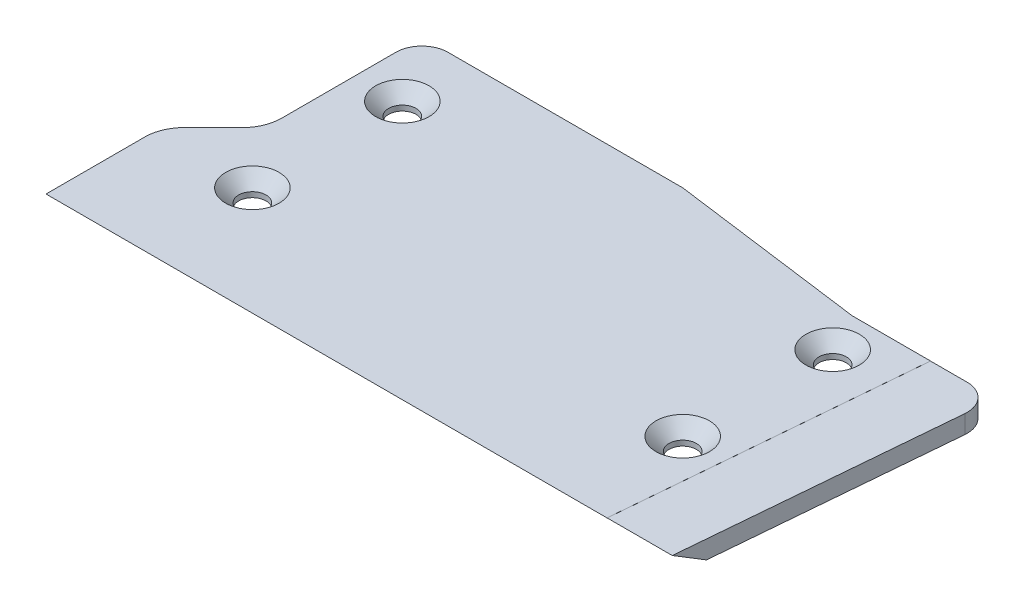
ISO-10303-21;
HEADER;
FILE_DESCRIPTION(('STEP AP214'),'2;1');
FILE_NAME('part.step','',(''),(''),'','','');
FILE_SCHEMA(('AUTOMOTIVE_DESIGN { 1 0 10303 214 1 1 1 1 }'));
ENDSEC;
DATA;
#1=APPLICATION_CONTEXT('core data for automotive mechanical design processes');
#2=APPLICATION_PROTOCOL_DEFINITION('international standard','automotive_design',2000,#1);
#3=PRODUCT_CONTEXT('',#1,'mechanical');
#4=PRODUCT('Part','Part','',(#3));
#5=PRODUCT_RELATED_PRODUCT_CATEGORY('part','',(#4));
#6=PRODUCT_DEFINITION_FORMATION('','',#4);
#7=PRODUCT_DEFINITION_CONTEXT('part definition',#1,'design');
#8=PRODUCT_DEFINITION('design','',#6,#7);
#9=PRODUCT_DEFINITION_SHAPE('','',#8);
#10=(LENGTH_UNIT() NAMED_UNIT(*) SI_UNIT(.MILLI.,.METRE.));
#11=(NAMED_UNIT(*) PLANE_ANGLE_UNIT() SI_UNIT($,.RADIAN.));
#12=(NAMED_UNIT(*) SI_UNIT($,.STERADIAN.) SOLID_ANGLE_UNIT());
#13=UNCERTAINTY_MEASURE_WITH_UNIT(LENGTH_MEASURE(1.E-05),#10,'distance_accuracy_value','');
#14=(GEOMETRIC_REPRESENTATION_CONTEXT(3) GLOBAL_UNCERTAINTY_ASSIGNED_CONTEXT((#13)) GLOBAL_UNIT_ASSIGNED_CONTEXT((#10,
#11,#12)) REPRESENTATION_CONTEXT('',''));
#15=CARTESIAN_POINT('',(0.,0.,0.));
#16=DIRECTION('',(0.,0.,1.));
#17=DIRECTION('',(1.,0.,0.));
#18=AXIS2_PLACEMENT_3D('',#15,#16,#17);
#19=CARTESIAN_POINT('',(92.,2.8,0.));
#20=DIRECTION('',(-0.996240588195683,0.,-0.0866296163648421));
#21=DIRECTION('',(-0.0866296163648421,0.,0.996240588195683));
#22=AXIS2_PLACEMENT_3D('',#19,#20,#21);
#23=PLANE('',#22);
#24=DIRECTION('',(0.0866296163648421,0.,-0.996240588195683));
#25=VECTOR('',#24,1.);
#26=CARTESIAN_POINT('',(92.,2.79,0.));
#27=LINE('',#26,#25);
#28=CARTESIAN_POINT('',(88.0316287538773,2.79000000000002,45.6362693304105));
#29=VERTEX_POINT('',#28);
#30=CARTESIAN_POINT('',(91.6220418725688,2.79,4.34651846545937));
#31=VERTEX_POINT('',#30);
#32=EDGE_CURVE('E58',#29,#31,#27,.T.);
#33=ORIENTED_EDGE('',*,*,#32,.F.);
#34=DIRECTION('',(0.0750939261482641,-0.498588232476366,-0.863580150705036));
#35=VECTOR('',#34,1.);
#36=CARTESIAN_POINT('',(88.,3.00000000000004,46.));
#37=LINE('',#36,#35);
#38=CARTESIAN_POINT('',(88.4518393411049,0.,40.8038475772933));
#39=VERTEX_POINT('',#38);
#40=EDGE_CURVE('E219',#29,#39,#37,.T.);
#41=ORIENTED_EDGE('',*,*,#40,.T.);
#42=DIRECTION('',(0.0866296163648421,0.,-0.996240588195683));
#43=VECTOR('',#42,1.);
#44=CARTESIAN_POINT('',(92.,0.,0.));
#45=LINE('',#44,#43);
#46=CARTESIAN_POINT('',(91.6220418725688,0.,4.34651846545937));
#47=VERTEX_POINT('',#46);
#48=EDGE_CURVE('E203',#39,#47,#45,.T.);
#49=ORIENTED_EDGE('',*,*,#48,.T.);
#50=DIRECTION('',(0.,-1.,0.));
#51=VECTOR('',#50,1.);
#52=CARTESIAN_POINT('',(91.6220418725688,2.8,4.34651846545937));
#53=LINE('',#52,#51);
#54=EDGE_CURVE('E283',#47,#31,#53,.F.);
#55=ORIENTED_EDGE('',*,*,#54,.T.);
#56=EDGE_LOOP('',(#33,#41,#49,#55));
#57=FACE_BOUND('',#56,.T.);
#58=ADVANCED_FACE('F43',(#57),#23,.F.);
#59=CARTESIAN_POINT('',(87.637079519786,2.8,4.));
#60=DIRECTION('',(0.,-1.,0.));
#61=DIRECTION('',(0.,0.,-1.));
#62=AXIS2_PLACEMENT_3D('',#59,#60,#61);
#63=CYLINDRICAL_SURFACE('',#62,4.);
#64=DIRECTION('',(0.,-1.,0.));
#65=VECTOR('',#64,1.);
#66=CARTESIAN_POINT('',(87.637079519786,2.8,0.));
#67=LINE('',#66,#65);
#68=CARTESIAN_POINT('',(87.637079519786,2.79,0.));
#69=VERTEX_POINT('',#68);
#70=CARTESIAN_POINT('',(87.637079519786,0.,0.));
#71=VERTEX_POINT('',#70);
#72=EDGE_CURVE('E281',#69,#71,#67,.T.);
#73=ORIENTED_EDGE('',*,*,#72,.F.);
#74=CARTESIAN_POINT('',(87.637079519786,2.79,4.));
#75=DIRECTION('',(0.,1.,0.));
#76=DIRECTION('',(0.,0.,1.));
#77=AXIS2_PLACEMENT_3D('',#74,#75,#76);
#78=CIRCLE('',#77,4.);
#79=EDGE_CURVE('E51',#69,#31,#78,.F.);
#80=ORIENTED_EDGE('',*,*,#79,.T.);
#81=ORIENTED_EDGE('',*,*,#54,.F.);
#82=CARTESIAN_POINT('',(87.637079519786,0.,4.));
#83=DIRECTION('',(0.,-1.,0.));
#84=DIRECTION('',(0.,0.,-1.));
#85=AXIS2_PLACEMENT_3D('',#82,#83,#84);
#86=CIRCLE('',#85,4.);
#87=EDGE_CURVE('E274',#71,#47,#86,.T.);
#88=ORIENTED_EDGE('',*,*,#87,.F.);
#89=EDGE_LOOP('',(#73,#80,#81,#88));
#90=FACE_BOUND('',#89,.T.);
#91=ADVANCED_FACE('F45',(#90),#63,.T.);
#92=CARTESIAN_POINT('',(0.,2.8,-4.));
#93=DIRECTION('',(1.,0.,0.));
#94=DIRECTION('',(0.,0.,-1.));
#95=AXIS2_PLACEMENT_3D('',#92,#93,#94);
#96=PLANE('',#95);
#97=DIRECTION('',(0.,0.,1.));
#98=VECTOR('',#97,1.);
#99=CARTESIAN_POINT('',(0.,2.8,-4.));
#100=LINE('',#99,#98);
#101=CARTESIAN_POINT('',(0.,2.8,0.));
#102=VERTEX_POINT('',#101);
#103=CARTESIAN_POINT('',(0.,2.8,17.5147186257614));
#104=VERTEX_POINT('',#103);
#105=EDGE_CURVE('E183',#102,#104,#100,.T.);
#106=ORIENTED_EDGE('',*,*,#105,.F.);
#107=DIRECTION('',(0.,-1.,0.));
#108=VECTOR('',#107,1.);
#109=CARTESIAN_POINT('',(0.,2.8,0.));
#110=LINE('',#109,#108);
#111=CARTESIAN_POINT('',(0.,0.,0.));
#112=VERTEX_POINT('',#111);
#113=EDGE_CURVE('E271',#102,#112,#110,.T.);
#114=ORIENTED_EDGE('',*,*,#113,.T.);
#115=DIRECTION('',(0.,0.,1.));
#116=VECTOR('',#115,1.);
#117=CARTESIAN_POINT('',(0.,0.,-4.));
#118=LINE('',#117,#116);
#119=CARTESIAN_POINT('',(0.,0.,17.5147186257614));
#120=VERTEX_POINT('',#119);
#121=EDGE_CURVE('E182',#112,#120,#118,.T.);
#122=ORIENTED_EDGE('',*,*,#121,.T.);
#123=DIRECTION('',(0.,-1.,0.));
#124=VECTOR('',#123,1.);
#125=CARTESIAN_POINT('',(0.,2.8,17.5147186257614));
#126=LINE('',#125,#124);
#127=EDGE_CURVE('E256',#120,#104,#126,.F.);
#128=ORIENTED_EDGE('',*,*,#127,.T.);
#129=EDGE_LOOP('',(#106,#114,#122,#128));
#130=FACE_BOUND('',#129,.T.);
#131=ADVANCED_FACE('F323',(#130),#96,.F.);
#132=CARTESIAN_POINT('',(-8.,2.8,28.));
#133=DIRECTION('',(0.707106781186547,0.,0.707106781186547));
#134=DIRECTION('',(0.707106781186548,0.,-0.707106781186548));
#135=AXIS2_PLACEMENT_3D('',#132,#133,#134);
#136=PLANE('',#135);
#137=DIRECTION('',(-0.707106781186548,0.,0.707106781186548));
#138=VECTOR('',#137,1.);
#139=CARTESIAN_POINT('',(-8.,2.8,28.));
#140=LINE('',#139,#138);
#141=CARTESIAN_POINT('',(-1.75735931288071,2.8,21.7573593128807));
#142=VERTEX_POINT('',#141);
#143=CARTESIAN_POINT('',(-6.24264068711929,2.8,26.2426406871193));
#144=VERTEX_POINT('',#143);
#145=EDGE_CURVE('E185',#142,#144,#140,.T.);
#146=ORIENTED_EDGE('',*,*,#145,.F.);
#147=DIRECTION('',(0.,-1.,0.));
#148=VECTOR('',#147,1.);
#149=CARTESIAN_POINT('',(-1.75735931288072,0.,21.7573593128807));
#150=LINE('',#149,#148);
#151=CARTESIAN_POINT('',(-1.75735931288071,0.,21.7573593128807));
#152=VERTEX_POINT('',#151);
#153=EDGE_CURVE('E253',#142,#152,#150,.T.);
#154=ORIENTED_EDGE('',*,*,#153,.T.);
#155=DIRECTION('',(-0.707106781186548,0.,0.707106781186548));
#156=VECTOR('',#155,1.);
#157=CARTESIAN_POINT('',(-8.,0.,28.));
#158=LINE('',#157,#156);
#159=CARTESIAN_POINT('',(-6.24264068711929,0.,26.2426406871193));
#160=VERTEX_POINT('',#159);
#161=EDGE_CURVE('E198',#152,#160,#158,.T.);
#162=ORIENTED_EDGE('',*,*,#161,.T.);
#163=DIRECTION('',(0.,-1.,0.));
#164=VECTOR('',#163,1.);
#165=CARTESIAN_POINT('',(-6.24264068711929,2.8,26.2426406871193));
#166=LINE('',#165,#164);
#167=EDGE_CURVE('E251',#160,#144,#166,.F.);
#168=ORIENTED_EDGE('',*,*,#167,.T.);
#169=EDGE_LOOP('',(#146,#154,#162,#168));
#170=FACE_BOUND('',#169,.T.);
#171=ADVANCED_FACE('F310',(#170),#136,.F.);
#172=CARTESIAN_POINT('',(-8.,2.8,46.));
#173=DIRECTION('',(1.,0.,0.));
#174=DIRECTION('',(0.,0.,-1.));
#175=AXIS2_PLACEMENT_3D('',#172,#173,#174);
#176=PLANE('',#175);
#177=DIRECTION('',(0.,0.,1.));
#178=VECTOR('',#177,1.);
#179=CARTESIAN_POINT('',(-8.,2.8,46.));
#180=LINE('',#179,#178);
#181=CARTESIAN_POINT('',(-8.,2.8,30.4852813742386));
#182=VERTEX_POINT('',#181);
#183=CARTESIAN_POINT('',(-8.,2.8,45.6535898384862));
#184=VERTEX_POINT('',#183);
#185=EDGE_CURVE('E189',#182,#184,#180,.T.);
#186=ORIENTED_EDGE('',*,*,#185,.F.);
#187=DIRECTION('',(0.,-1.,0.));
#188=VECTOR('',#187,1.);
#189=CARTESIAN_POINT('',(-8.,2.8,30.4852813742386));
#190=LINE('',#189,#188);
#191=CARTESIAN_POINT('',(-8.,0.,30.4852813742386));
#192=VERTEX_POINT('',#191);
#193=EDGE_CURVE('E259',#182,#192,#190,.T.);
#194=ORIENTED_EDGE('',*,*,#193,.T.);
#195=DIRECTION('',(0.,0.,1.));
#196=VECTOR('',#195,1.);
#197=CARTESIAN_POINT('',(-8.,0.,46.));
#198=LINE('',#197,#196);
#199=CARTESIAN_POINT('',(-8.,0.,40.8038475772933));
#200=VERTEX_POINT('',#199);
#201=EDGE_CURVE('E201',#192,#200,#198,.T.);
#202=ORIENTED_EDGE('',*,*,#201,.T.);
#203=DIRECTION('',(0.,0.499999999999997,0.866025403784441));
#204=VECTOR('',#203,1.);
#205=CARTESIAN_POINT('',(-8.00000000000001,3.00000000000003,46.));
#206=LINE('',#205,#204);
#207=EDGE_CURVE('E224',#200,#184,#206,.T.);
#208=ORIENTED_EDGE('',*,*,#207,.T.);
#209=EDGE_LOOP('',(#186,#194,#202,#208));
#210=FACE_BOUND('',#209,.T.);
#211=ADVANCED_FACE('F303',(#210),#176,.F.);
#212=CARTESIAN_POINT('',(70.,2.8,0.));
#213=DIRECTION('',(0.,0.,1.));
#214=DIRECTION('',(1.,0.,0.));
#215=AXIS2_PLACEMENT_3D('',#212,#213,#214);
#216=PLANE('',#215);
#217=DIRECTION('',(-1.,0.,0.));
#218=VECTOR('',#217,1.);
#219=CARTESIAN_POINT('',(70.,2.8,0.));
#220=LINE('',#219,#218);
#221=CARTESIAN_POINT('',(82.0111837990123,2.8,0.));
#222=VERTEX_POINT('',#221);
#223=CARTESIAN_POINT('',(70.,2.8,0.));
#224=VERTEX_POINT('',#223);
#225=EDGE_CURVE('E163',#222,#224,#220,.T.);
#226=ORIENTED_EDGE('',*,*,#225,.F.);
#227=DIRECTION('',(0.,1.,0.));
#228=VECTOR('',#227,1.);
#229=CARTESIAN_POINT('',(82.0111837990123,2.79,0.));
#230=LINE('',#229,#228);
#231=CARTESIAN_POINT('',(82.0111837990123,2.79,0.));
#232=VERTEX_POINT('',#231);
#233=EDGE_CURVE('E152',#232,#222,#230,.T.);
#234=ORIENTED_EDGE('',*,*,#233,.F.);
#235=DIRECTION('',(-1.,0.,0.));
#236=VECTOR('',#235,1.);
#237=CARTESIAN_POINT('',(70.,2.79,0.));
#238=LINE('',#237,#236);
#239=EDGE_CURVE('E144',#69,#232,#238,.T.);
#240=ORIENTED_EDGE('',*,*,#239,.F.);
#241=ORIENTED_EDGE('',*,*,#72,.T.);
#242=DIRECTION('',(-1.,0.,0.));
#243=VECTOR('',#242,1.);
#244=CARTESIAN_POINT('',(70.,0.,0.));
#245=LINE('',#244,#243);
#246=CARTESIAN_POINT('',(70.,0.,0.));
#247=VERTEX_POINT('',#246);
#248=EDGE_CURVE('E206',#71,#247,#245,.T.);
#249=ORIENTED_EDGE('',*,*,#248,.T.);
#250=DIRECTION('',(0.,-1.,0.));
#251=VECTOR('',#250,1.);
#252=CARTESIAN_POINT('',(70.,2.8,0.));
#253=LINE('',#252,#251);
#254=EDGE_CURVE('E213',#224,#247,#253,.T.);
#255=ORIENTED_EDGE('',*,*,#254,.F.);
#256=EDGE_LOOP('',(#226,#234,#240,#241,#249,#255));
#257=FACE_BOUND('',#256,.T.);
#258=ADVANCED_FACE('F161',(#257),#216,.F.);
#259=CARTESIAN_POINT('',(40.,2.8,-4.));
#260=DIRECTION('',(-0.132163720091018,0.,0.991227900682635));
#261=DIRECTION('',(0.991227900682635,0.,0.132163720091018));
#262=AXIS2_PLACEMENT_3D('',#259,#260,#261);
#263=PLANE('',#262);
#264=DIRECTION('',(-0.991227900682635,0.,-0.132163720091018));
#265=VECTOR('',#264,1.);
#266=CARTESIAN_POINT('',(40.,0.,-4.));
#267=LINE('',#266,#265);
#268=CARTESIAN_POINT('',(40.,0.,-4.));
#269=VERTEX_POINT('',#268);
#270=EDGE_CURVE('E208',#247,#269,#267,.T.);
#271=ORIENTED_EDGE('',*,*,#270,.T.);
#272=DIRECTION('',(0.,-1.,0.));
#273=VECTOR('',#272,1.);
#274=CARTESIAN_POINT('',(40.,2.8,-4.));
#275=LINE('',#274,#273);
#276=CARTESIAN_POINT('',(40.,2.8,-4.));
#277=VERTEX_POINT('',#276);
#278=EDGE_CURVE('E196',#277,#269,#275,.T.);
#279=ORIENTED_EDGE('',*,*,#278,.F.);
#280=DIRECTION('',(-0.991227900682635,0.,-0.132163720091018));
#281=VECTOR('',#280,1.);
#282=CARTESIAN_POINT('',(40.,2.8,-4.));
#283=LINE('',#282,#281);
#284=EDGE_CURVE('E192',#224,#277,#283,.T.);
#285=ORIENTED_EDGE('',*,*,#284,.F.);
#286=ORIENTED_EDGE('',*,*,#254,.T.);
#287=EDGE_LOOP('',(#271,#279,#285,#286));
#288=FACE_BOUND('',#287,.T.);
#289=ADVANCED_FACE('F333',(#288),#263,.F.);
#290=CARTESIAN_POINT('',(0.,2.8,-4.));
#291=DIRECTION('',(0.,0.,1.));
#292=DIRECTION('',(1.,0.,0.));
#293=AXIS2_PLACEMENT_3D('',#290,#291,#292);
#294=PLANE('',#293);
#295=DIRECTION('',(-1.,0.,0.));
#296=VECTOR('',#295,1.);
#297=CARTESIAN_POINT('',(0.,0.,-4.));
#298=LINE('',#297,#296);
#299=CARTESIAN_POINT('',(4.,0.,-4.));
#300=VERTEX_POINT('',#299);
#301=EDGE_CURVE('E186',#269,#300,#298,.T.);
#302=ORIENTED_EDGE('',*,*,#301,.T.);
#303=DIRECTION('',(0.,-1.,0.));
#304=VECTOR('',#303,1.);
#305=CARTESIAN_POINT('',(4.,2.8,-4.));
#306=LINE('',#305,#304);
#307=CARTESIAN_POINT('',(4.,2.8,-4.));
#308=VERTEX_POINT('',#307);
#309=EDGE_CURVE('E66',#300,#308,#306,.F.);
#310=ORIENTED_EDGE('',*,*,#309,.T.);
#311=DIRECTION('',(-1.,0.,0.));
#312=VECTOR('',#311,1.);
#313=CARTESIAN_POINT('',(0.,2.8,-4.));
#314=LINE('',#313,#312);
#315=EDGE_CURVE('E194',#277,#308,#314,.T.);
#316=ORIENTED_EDGE('',*,*,#315,.F.);
#317=ORIENTED_EDGE('',*,*,#278,.T.);
#318=EDGE_LOOP('',(#302,#310,#316,#317));
#319=FACE_BOUND('',#318,.T.);
#320=ADVANCED_FACE('F330',(#319),#294,.F.);
#321=CARTESIAN_POINT('',(0.,2.8,0.));
#322=DIRECTION('',(0.,-1.,0.));
#323=DIRECTION('',(0.,0.,-1.));
#324=AXIS2_PLACEMENT_3D('',#321,#322,#323);
#325=PLANE('',#324);
#326=CARTESIAN_POINT('',(73.,2.8,6.));
#327=DIRECTION('',(0.,-1.,0.));
#328=DIRECTION('',(0.,0.,-1.));
#329=AXIS2_PLACEMENT_3D('',#326,#327,#328);
#330=CIRCLE('',#329,4.10000000000001);
#331=CARTESIAN_POINT('',(73.,2.8,1.89999999999999));
#332=VERTEX_POINT('',#331);
#333=EDGE_CURVE('E239',#332,#332,#330,.T.);
#334=ORIENTED_EDGE('',*,*,#333,.T.);
#335=EDGE_LOOP('',(#334));
#336=FACE_BOUND('',#335,.T.);
#337=CARTESIAN_POINT('',(73.,2.8,29.));
#338=DIRECTION('',(0.,-1.,0.));
#339=DIRECTION('',(0.,0.,-1.));
#340=AXIS2_PLACEMENT_3D('',#337,#338,#339);
#341=CIRCLE('',#340,4.10000000000001);
#342=CARTESIAN_POINT('',(73.,2.8,24.9));
#343=VERTEX_POINT('',#342);
#344=EDGE_CURVE('E236',#343,#343,#341,.T.);
#345=ORIENTED_EDGE('',*,*,#344,.T.);
#346=EDGE_LOOP('',(#345));
#347=FACE_BOUND('',#346,.T.);
#348=CARTESIAN_POINT('',(7.00000000000001,2.8,6.));
#349=DIRECTION('',(0.,-1.,0.));
#350=DIRECTION('',(0.,0.,-1.));
#351=AXIS2_PLACEMENT_3D('',#348,#349,#350);
#352=CIRCLE('',#351,4.10000000000001);
#353=CARTESIAN_POINT('',(7.00000000000001,2.8,1.89999999999999));
#354=VERTEX_POINT('',#353);
#355=EDGE_CURVE('E233',#354,#354,#352,.T.);
#356=ORIENTED_EDGE('',*,*,#355,.T.);
#357=EDGE_LOOP('',(#356));
#358=FACE_BOUND('',#357,.T.);
#359=CARTESIAN_POINT('',(7.00000000000001,2.8,29.));
#360=DIRECTION('',(0.,-1.,0.));
#361=DIRECTION('',(0.,0.,-1.));
#362=AXIS2_PLACEMENT_3D('',#359,#360,#361);
#363=CIRCLE('',#362,4.10000000000001);
#364=CARTESIAN_POINT('',(7.00000000000001,2.8,24.9));
#365=VERTEX_POINT('',#364);
#366=EDGE_CURVE('E230',#365,#365,#363,.T.);
#367=ORIENTED_EDGE('',*,*,#366,.T.);
#368=EDGE_LOOP('',(#367));
#369=FACE_BOUND('',#368,.T.);
#370=DIRECTION('',(1.,0.,0.));
#371=VECTOR('',#370,1.);
#372=CARTESIAN_POINT('',(88.,2.8,45.6535898384862));
#373=LINE('',#372,#371);
#374=CARTESIAN_POINT('',(78.0413064217526,2.8,45.6535898384862));
#375=VERTEX_POINT('',#374);
#376=EDGE_CURVE('E216',#184,#375,#373,.T.);
#377=ORIENTED_EDGE('',*,*,#376,.T.);
#378=DIRECTION('',(-0.0866296163648422,0.,0.996240588195683));
#379=VECTOR('',#378,1.);
#380=CARTESIAN_POINT('',(78.0413064217526,2.8,45.6535898384862));
#381=LINE('',#380,#379);
#382=EDGE_CURVE('E158',#222,#375,#381,.T.);
#383=ORIENTED_EDGE('',*,*,#382,.F.);
#384=ORIENTED_EDGE('',*,*,#225,.T.);
#385=ORIENTED_EDGE('',*,*,#284,.T.);
#386=ORIENTED_EDGE('',*,*,#315,.T.);
#387=CARTESIAN_POINT('',(4.,2.8,0.));
#388=DIRECTION('',(0.,-1.,0.));
#389=DIRECTION('',(0.,0.,-1.));
#390=AXIS2_PLACEMENT_3D('',#387,#388,#389);
#391=CIRCLE('',#390,4.);
#392=EDGE_CURVE('E279',#308,#102,#391,.F.);
#393=ORIENTED_EDGE('',*,*,#392,.T.);
#394=ORIENTED_EDGE('',*,*,#105,.T.);
#395=CARTESIAN_POINT('',(-6.,2.8,17.5147186257614));
#396=DIRECTION('',(0.,-1.,0.));
#397=DIRECTION('',(0.,0.,-1.));
#398=AXIS2_PLACEMENT_3D('',#395,#396,#397);
#399=CIRCLE('',#398,6.);
#400=EDGE_CURVE('E269',#104,#142,#399,.T.);
#401=ORIENTED_EDGE('',*,*,#400,.T.);
#402=ORIENTED_EDGE('',*,*,#145,.T.);
#403=CARTESIAN_POINT('',(-2.,2.8,30.4852813742386));
#404=DIRECTION('',(0.,-1.,0.));
#405=DIRECTION('',(0.,0.,-1.));
#406=AXIS2_PLACEMENT_3D('',#403,#404,#405);
#407=CIRCLE('',#406,6.);
#408=EDGE_CURVE('E264',#144,#182,#407,.F.);
#409=ORIENTED_EDGE('',*,*,#408,.T.);
#410=ORIENTED_EDGE('',*,*,#185,.T.);
#411=EDGE_LOOP('',(#377,#383,#384,#385,#386,#393,#394,#401,#402,#409,#410));
#412=FACE_BOUND('',#411,.T.);
#413=ADVANCED_FACE('F315',(#336,#347,#358,#369,#412),#325,.F.);
#414=CARTESIAN_POINT('',(0.,0.,0.));
#415=DIRECTION('',(0.,-1.,0.));
#416=DIRECTION('',(0.,0.,-1.));
#417=AXIS2_PLACEMENT_3D('',#414,#415,#416);
#418=PLANE('',#417);
#419=CARTESIAN_POINT('',(7.00000000000001,0.,29.));
#420=DIRECTION('',(0.,1.,0.));
#421=DIRECTION('',(0.,0.,1.));
#422=AXIS2_PLACEMENT_3D('',#419,#420,#421);
#423=CIRCLE('',#422,2.1);
#424=CARTESIAN_POINT('',(7.00000000000001,0.,31.1));
#425=VERTEX_POINT('',#424);
#426=EDGE_CURVE('E174',#425,#425,#423,.T.);
#427=ORIENTED_EDGE('',*,*,#426,.T.);
#428=EDGE_LOOP('',(#427));
#429=FACE_BOUND('',#428,.T.);
#430=CARTESIAN_POINT('',(73.,0.,6.));
#431=DIRECTION('',(0.,1.,0.));
#432=DIRECTION('',(0.,0.,1.));
#433=AXIS2_PLACEMENT_3D('',#430,#431,#432);
#434=CIRCLE('',#433,2.1);
#435=CARTESIAN_POINT('',(73.,0.,8.1));
#436=VERTEX_POINT('',#435);
#437=EDGE_CURVE('E173',#436,#436,#434,.T.);
#438=ORIENTED_EDGE('',*,*,#437,.T.);
#439=EDGE_LOOP('',(#438));
#440=FACE_BOUND('',#439,.T.);
#441=CARTESIAN_POINT('',(73.,0.,29.));
#442=DIRECTION('',(0.,1.,0.));
#443=DIRECTION('',(0.,0.,1.));
#444=AXIS2_PLACEMENT_3D('',#441,#442,#443);
#445=CIRCLE('',#444,2.1);
#446=CARTESIAN_POINT('',(73.,0.,31.1));
#447=VERTEX_POINT('',#446);
#448=EDGE_CURVE('E170',#447,#447,#445,.T.);
#449=ORIENTED_EDGE('',*,*,#448,.T.);
#450=EDGE_LOOP('',(#449));
#451=FACE_BOUND('',#450,.T.);
#452=CARTESIAN_POINT('',(7.00000000000001,0.,6.));
#453=DIRECTION('',(0.,1.,0.));
#454=DIRECTION('',(0.,0.,1.));
#455=AXIS2_PLACEMENT_3D('',#452,#453,#454);
#456=CIRCLE('',#455,2.1);
#457=CARTESIAN_POINT('',(7.00000000000001,0.,8.1));
#458=VERTEX_POINT('',#457);
#459=EDGE_CURVE('E177',#458,#458,#456,.T.);
#460=ORIENTED_EDGE('',*,*,#459,.T.);
#461=EDGE_LOOP('',(#460));
#462=FACE_BOUND('',#461,.T.);
#463=ORIENTED_EDGE('',*,*,#121,.F.);
#464=CARTESIAN_POINT('',(4.,0.,0.));
#465=DIRECTION('',(0.,-1.,0.));
#466=DIRECTION('',(0.,0.,-1.));
#467=AXIS2_PLACEMENT_3D('',#464,#465,#466);
#468=CIRCLE('',#467,4.);
#469=EDGE_CURVE('E276',#112,#300,#468,.T.);
#470=ORIENTED_EDGE('',*,*,#469,.T.);
#471=ORIENTED_EDGE('',*,*,#301,.F.);
#472=ORIENTED_EDGE('',*,*,#270,.F.);
#473=ORIENTED_EDGE('',*,*,#248,.F.);
#474=ORIENTED_EDGE('',*,*,#87,.T.);
#475=ORIENTED_EDGE('',*,*,#48,.F.);
#476=DIRECTION('',(-1.,0.,0.));
#477=VECTOR('',#476,1.);
#478=CARTESIAN_POINT('',(-8.,0.,40.8038475772933));
#479=LINE('',#478,#477);
#480=EDGE_CURVE('E221',#39,#200,#479,.T.);
#481=ORIENTED_EDGE('',*,*,#480,.T.);
#482=ORIENTED_EDGE('',*,*,#201,.F.);
#483=CARTESIAN_POINT('',(-2.,0.,30.4852813742386));
#484=DIRECTION('',(0.,-1.,0.));
#485=DIRECTION('',(0.,0.,-1.));
#486=AXIS2_PLACEMENT_3D('',#483,#484,#485);
#487=CIRCLE('',#486,6.);
#488=EDGE_CURVE('E262',#192,#160,#487,.T.);
#489=ORIENTED_EDGE('',*,*,#488,.T.);
#490=ORIENTED_EDGE('',*,*,#161,.F.);
#491=CARTESIAN_POINT('',(-6.,0.,17.5147186257614));
#492=DIRECTION('',(0.,-1.,0.));
#493=DIRECTION('',(0.,0.,-1.));
#494=AXIS2_PLACEMENT_3D('',#491,#492,#493);
#495=CIRCLE('',#494,6.);
#496=EDGE_CURVE('E266',#152,#120,#495,.F.);
#497=ORIENTED_EDGE('',*,*,#496,.T.);
#498=EDGE_LOOP('',(#463,#470,#471,#472,#473,#474,#475,#481,#482,#489,#490,#497));
#499=FACE_BOUND('',#498,.T.);
#500=ADVANCED_FACE('F294',(#429,#440,#451,#462,#499),#418,.T.);
#501=CARTESIAN_POINT('',(88.,3.00000000000004,46.));
#502=DIRECTION('',(0.,-0.866025403784441,0.499999999999997));
#503=DIRECTION('',(-1.,0.,0.));
#504=AXIS2_PLACEMENT_3D('',#501,#502,#503);
#505=PLANE('',#504);
#506=DIRECTION('',(0.0750939261482642,-0.498588232476366,-0.863580150705036));
#507=VECTOR('',#506,1.);
#508=CARTESIAN_POINT('',(78.0675117099201,2.62600925295653,45.35222902456));
#509=LINE('',#508,#507);
#510=CARTESIAN_POINT('',(78.0428125528897,2.79,45.6362693304105));
#511=VERTEX_POINT('',#510);
#512=EDGE_CURVE('E11',#375,#511,#509,.T.);
#513=ORIENTED_EDGE('',*,*,#512,.F.);
#514=ORIENTED_EDGE('',*,*,#376,.F.);
#515=ORIENTED_EDGE('',*,*,#207,.F.);
#516=ORIENTED_EDGE('',*,*,#480,.F.);
#517=ORIENTED_EDGE('',*,*,#40,.F.);
#518=DIRECTION('',(-1.,0.,0.));
#519=VECTOR('',#518,1.);
#520=CARTESIAN_POINT('',(88.,2.79,45.6362693304105));
#521=LINE('',#520,#519);
#522=EDGE_CURVE('E168',#29,#511,#521,.T.);
#523=ORIENTED_EDGE('',*,*,#522,.T.);
#524=EDGE_LOOP('',(#513,#514,#515,#516,#517,#523));
#525=FACE_BOUND('',#524,.T.);
#526=ADVANCED_FACE('F299',(#525),#505,.T.);
#527=CARTESIAN_POINT('',(7.00000000000001,0.,6.));
#528=DIRECTION('',(0.,1.,0.));
#529=DIRECTION('',(0.,0.,1.));
#530=AXIS2_PLACEMENT_3D('',#527,#528,#529);
#531=CYLINDRICAL_SURFACE('',#530,2.1);
#532=CARTESIAN_POINT('',(7.00000000000001,0.799999999999987,6.));
#533=DIRECTION('',(0.,-1.,0.));
#534=DIRECTION('',(0.,0.,-1.));
#535=AXIS2_PLACEMENT_3D('',#532,#533,#534);
#536=CIRCLE('',#535,2.1);
#537=CARTESIAN_POINT('',(7.00000000000001,0.799999999999987,3.9));
#538=VERTEX_POINT('',#537);
#539=EDGE_CURVE('E245',#538,#538,#536,.F.);
#540=ORIENTED_EDGE('',*,*,#539,.T.);
#541=EDGE_LOOP('',(#540));
#542=FACE_BOUND('',#541,.T.);
#543=ORIENTED_EDGE('',*,*,#459,.F.);
#544=EDGE_LOOP('',(#543));
#545=FACE_BOUND('',#544,.T.);
#546=ADVANCED_FACE('F362',(#542,#545),#531,.F.);
#547=CARTESIAN_POINT('',(73.,0.,29.));
#548=DIRECTION('',(0.,1.,0.));
#549=DIRECTION('',(0.,0.,1.));
#550=AXIS2_PLACEMENT_3D('',#547,#548,#549);
#551=CYLINDRICAL_SURFACE('',#550,2.1);
#552=CARTESIAN_POINT('',(73.,0.79999999999999,29.));
#553=DIRECTION('',(0.,-1.,0.));
#554=DIRECTION('',(0.,0.,-1.));
#555=AXIS2_PLACEMENT_3D('',#552,#553,#554);
#556=CIRCLE('',#555,2.1);
#557=CARTESIAN_POINT('',(73.,0.79999999999999,26.9));
#558=VERTEX_POINT('',#557);
#559=EDGE_CURVE('E242',#558,#558,#556,.F.);
#560=ORIENTED_EDGE('',*,*,#559,.T.);
#561=EDGE_LOOP('',(#560));
#562=FACE_BOUND('',#561,.T.);
#563=ORIENTED_EDGE('',*,*,#448,.F.);
#564=EDGE_LOOP('',(#563));
#565=FACE_BOUND('',#564,.T.);
#566=ADVANCED_FACE('F404',(#562,#565),#551,.F.);
#567=CARTESIAN_POINT('',(73.,0.,6.));
#568=DIRECTION('',(0.,1.,0.));
#569=DIRECTION('',(0.,0.,1.));
#570=AXIS2_PLACEMENT_3D('',#567,#568,#569);
#571=CYLINDRICAL_SURFACE('',#570,2.1);
#572=CARTESIAN_POINT('',(73.,0.79999999999999,6.));
#573=DIRECTION('',(0.,-1.,0.));
#574=DIRECTION('',(0.,0.,-1.));
#575=AXIS2_PLACEMENT_3D('',#572,#573,#574);
#576=CIRCLE('',#575,2.1);
#577=CARTESIAN_POINT('',(73.,0.79999999999999,3.9));
#578=VERTEX_POINT('',#577);
#579=EDGE_CURVE('E227',#578,#578,#576,.F.);
#580=ORIENTED_EDGE('',*,*,#579,.T.);
#581=EDGE_LOOP('',(#580));
#582=FACE_BOUND('',#581,.T.);
#583=ORIENTED_EDGE('',*,*,#437,.F.);
#584=EDGE_LOOP('',(#583));
#585=FACE_BOUND('',#584,.T.);
#586=ADVANCED_FACE('F407',(#582,#585),#571,.F.);
#587=CARTESIAN_POINT('',(7.00000000000001,0.,29.));
#588=DIRECTION('',(0.,1.,0.));
#589=DIRECTION('',(0.,0.,1.));
#590=AXIS2_PLACEMENT_3D('',#587,#588,#589);
#591=CYLINDRICAL_SURFACE('',#590,2.1);
#592=CARTESIAN_POINT('',(7.00000000000001,0.799999999999987,29.));
#593=DIRECTION('',(0.,-1.,0.));
#594=DIRECTION('',(0.,0.,-1.));
#595=AXIS2_PLACEMENT_3D('',#592,#593,#594);
#596=CIRCLE('',#595,2.1);
#597=CARTESIAN_POINT('',(7.00000000000001,0.799999999999987,26.9));
#598=VERTEX_POINT('',#597);
#599=EDGE_CURVE('E248',#598,#598,#596,.F.);
#600=ORIENTED_EDGE('',*,*,#599,.T.);
#601=EDGE_LOOP('',(#600));
#602=FACE_BOUND('',#601,.T.);
#603=ORIENTED_EDGE('',*,*,#426,.F.);
#604=EDGE_LOOP('',(#603));
#605=FACE_BOUND('',#604,.T.);
#606=ADVANCED_FACE('F370',(#602,#605),#591,.F.);
#607=CARTESIAN_POINT('',(73.,0.79999999999999,6.));
#608=DIRECTION('',(0.,1.,0.));
#609=DIRECTION('',(0.,0.,1.));
#610=AXIS2_PLACEMENT_3D('',#607,#608,#609);
#611=CONICAL_SURFACE('',#610,2.1,0.785398163397446);
#612=ORIENTED_EDGE('',*,*,#333,.F.);
#613=EDGE_LOOP('',(#612));
#614=FACE_BOUND('',#613,.T.);
#615=ORIENTED_EDGE('',*,*,#579,.F.);
#616=EDGE_LOOP('',(#615));
#617=FACE_BOUND('',#616,.T.);
#618=ADVANCED_FACE('F363',(#614,#617),#611,.F.);
#619=CARTESIAN_POINT('',(73.,0.79999999999999,29.));
#620=DIRECTION('',(0.,1.,0.));
#621=DIRECTION('',(0.,0.,1.));
#622=AXIS2_PLACEMENT_3D('',#619,#620,#621);
#623=CONICAL_SURFACE('',#622,2.1,0.785398163397446);
#624=ORIENTED_EDGE('',*,*,#344,.F.);
#625=EDGE_LOOP('',(#624));
#626=FACE_BOUND('',#625,.T.);
#627=ORIENTED_EDGE('',*,*,#559,.F.);
#628=EDGE_LOOP('',(#627));
#629=FACE_BOUND('',#628,.T.);
#630=ADVANCED_FACE('F369',(#626,#629),#623,.F.);
#631=CARTESIAN_POINT('',(7.00000000000001,0.799999999999987,6.));
#632=DIRECTION('',(0.,1.,0.));
#633=DIRECTION('',(0.,0.,1.));
#634=AXIS2_PLACEMENT_3D('',#631,#632,#633);
#635=CONICAL_SURFACE('',#634,2.1,0.785398163397446);
#636=ORIENTED_EDGE('',*,*,#355,.F.);
#637=EDGE_LOOP('',(#636));
#638=FACE_BOUND('',#637,.T.);
#639=ORIENTED_EDGE('',*,*,#539,.F.);
#640=EDGE_LOOP('',(#639));
#641=FACE_BOUND('',#640,.T.);
#642=ADVANCED_FACE('F377',(#638,#641),#635,.F.);
#643=CARTESIAN_POINT('',(7.00000000000001,0.799999999999987,29.));
#644=DIRECTION('',(0.,1.,0.));
#645=DIRECTION('',(0.,0.,1.));
#646=AXIS2_PLACEMENT_3D('',#643,#644,#645);
#647=CONICAL_SURFACE('',#646,2.1,0.785398163397446);
#648=ORIENTED_EDGE('',*,*,#366,.F.);
#649=EDGE_LOOP('',(#648));
#650=FACE_BOUND('',#649,.T.);
#651=ORIENTED_EDGE('',*,*,#599,.F.);
#652=EDGE_LOOP('',(#651));
#653=FACE_BOUND('',#652,.T.);
#654=ADVANCED_FACE('F384',(#650,#653),#647,.F.);
#655=CARTESIAN_POINT('',(-6.,2.8,17.5147186257614));
#656=DIRECTION('',(0.,1.,0.));
#657=DIRECTION('',(0.,0.,1.));
#658=AXIS2_PLACEMENT_3D('',#655,#656,#657);
#659=CYLINDRICAL_SURFACE('',#658,6.);
#660=ORIENTED_EDGE('',*,*,#400,.F.);
#661=ORIENTED_EDGE('',*,*,#127,.F.);
#662=ORIENTED_EDGE('',*,*,#496,.F.);
#663=ORIENTED_EDGE('',*,*,#153,.F.);
#664=EDGE_LOOP('',(#660,#661,#662,#663));
#665=FACE_BOUND('',#664,.T.);
#666=ADVANCED_FACE('F318',(#665),#659,.F.);
#667=CARTESIAN_POINT('',(-2.,2.8,30.4852813742386));
#668=DIRECTION('',(0.,-1.,0.));
#669=DIRECTION('',(0.,0.,-1.));
#670=AXIS2_PLACEMENT_3D('',#667,#668,#669);
#671=CYLINDRICAL_SURFACE('',#670,6.);
#672=ORIENTED_EDGE('',*,*,#408,.F.);
#673=ORIENTED_EDGE('',*,*,#167,.F.);
#674=ORIENTED_EDGE('',*,*,#488,.F.);
#675=ORIENTED_EDGE('',*,*,#193,.F.);
#676=EDGE_LOOP('',(#672,#673,#674,#675));
#677=FACE_BOUND('',#676,.T.);
#678=ADVANCED_FACE('F313',(#677),#671,.T.);
#679=CARTESIAN_POINT('',(4.,2.8,0.));
#680=DIRECTION('',(0.,-1.,0.));
#681=DIRECTION('',(0.,0.,-1.));
#682=AXIS2_PLACEMENT_3D('',#679,#680,#681);
#683=CYLINDRICAL_SURFACE('',#682,4.);
#684=ORIENTED_EDGE('',*,*,#392,.F.);
#685=ORIENTED_EDGE('',*,*,#309,.F.);
#686=ORIENTED_EDGE('',*,*,#469,.F.);
#687=ORIENTED_EDGE('',*,*,#113,.F.);
#688=EDGE_LOOP('',(#684,#685,#686,#687));
#689=FACE_BOUND('',#688,.T.);
#690=ADVANCED_FACE('F327',(#689),#683,.T.);
#691=CARTESIAN_POINT('',(78.0413064217526,2.79,45.6535898384862));
#692=DIRECTION('',(-0.996240588195683,0.,-0.0866296163648422));
#693=DIRECTION('',(-0.0866296163648422,0.,0.996240588195683));
#694=AXIS2_PLACEMENT_3D('',#691,#692,#693);
#695=PLANE('',#694);
#696=ORIENTED_EDGE('',*,*,#512,.T.);
#697=DIRECTION('',(-0.0866296163648422,0.,0.996240588195683));
#698=VECTOR('',#697,1.);
#699=CARTESIAN_POINT('',(78.0413064217526,2.79,45.6535898384862));
#700=LINE('',#699,#698);
#701=EDGE_CURVE('E147',#232,#511,#700,.T.);
#702=ORIENTED_EDGE('',*,*,#701,.F.);
#703=ORIENTED_EDGE('',*,*,#233,.T.);
#704=ORIENTED_EDGE('',*,*,#382,.T.);
#705=EDGE_LOOP('',(#696,#702,#703,#704));
#706=FACE_BOUND('',#705,.T.);
#707=ADVANCED_FACE('F155',(#706),#695,.F.);
#708=CARTESIAN_POINT('',(0.,2.79,0.));
#709=DIRECTION('',(0.,1.,0.));
#710=DIRECTION('',(0.,0.,1.));
#711=AXIS2_PLACEMENT_3D('',#708,#709,#710);
#712=PLANE('',#711);
#713=ORIENTED_EDGE('',*,*,#32,.T.);
#714=ORIENTED_EDGE('',*,*,#79,.F.);
#715=ORIENTED_EDGE('',*,*,#239,.T.);
#716=ORIENTED_EDGE('',*,*,#701,.T.);
#717=ORIENTED_EDGE('',*,*,#522,.F.);
#718=EDGE_LOOP('',(#713,#714,#715,#716,#717));
#719=FACE_BOUND('',#718,.T.);
#720=ADVANCED_FACE('F146',(#719),#712,.T.);
#721=CLOSED_SHELL('',(#58,#91,#131,#171,#211,#258,#289,#320,#413,#500,#526,#546,#566,#586,#606,
#618,#630,#642,#654,#666,#678,#690,#707,#720));
#722=MANIFOLD_SOLID_BREP('B2',#721);
#723=ADVANCED_BREP_SHAPE_REPRESENTATION('',(#18,#722),#14);
#724=SHAPE_DEFINITION_REPRESENTATION(#9,#723);
ENDSEC;
END-ISO-10303-21;
